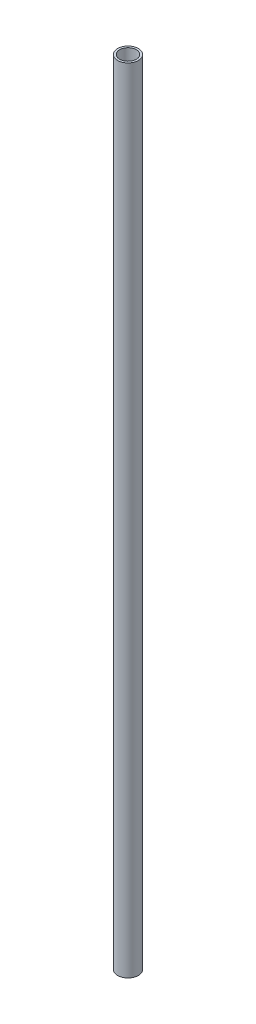
ISO-10303-21;
HEADER;
FILE_DESCRIPTION(('STEP AP214'),'2;1');
FILE_NAME('part.step','',(''),(''),'','','');
FILE_SCHEMA(('AUTOMOTIVE_DESIGN { 1 0 10303 214 1 1 1 1 }'));
ENDSEC;
DATA;
#1=APPLICATION_CONTEXT('core data for automotive mechanical design processes');
#2=APPLICATION_PROTOCOL_DEFINITION('international standard','automotive_design',2000,#1);
#3=PRODUCT_CONTEXT('',#1,'mechanical');
#4=PRODUCT('Part','Part','',(#3));
#5=PRODUCT_RELATED_PRODUCT_CATEGORY('part','',(#4));
#6=PRODUCT_DEFINITION_FORMATION('','',#4);
#7=PRODUCT_DEFINITION_CONTEXT('part definition',#1,'design');
#8=PRODUCT_DEFINITION('design','',#6,#7);
#9=PRODUCT_DEFINITION_SHAPE('','',#8);
#10=(LENGTH_UNIT() NAMED_UNIT(*) SI_UNIT(.MILLI.,.METRE.));
#11=(NAMED_UNIT(*) PLANE_ANGLE_UNIT() SI_UNIT($,.RADIAN.));
#12=(NAMED_UNIT(*) SI_UNIT($,.STERADIAN.) SOLID_ANGLE_UNIT());
#13=UNCERTAINTY_MEASURE_WITH_UNIT(LENGTH_MEASURE(1.E-05),#10,'distance_accuracy_value','');
#14=(GEOMETRIC_REPRESENTATION_CONTEXT(3) GLOBAL_UNCERTAINTY_ASSIGNED_CONTEXT((#13)) GLOBAL_UNIT_ASSIGNED_CONTEXT((#10,
#11,#12)) REPRESENTATION_CONTEXT('',''));
#15=CARTESIAN_POINT('',(0.,0.,0.));
#16=DIRECTION('',(0.,0.,1.));
#17=DIRECTION('',(1.,0.,0.));
#18=AXIS2_PLACEMENT_3D('',#15,#16,#17);
#19=CARTESIAN_POINT('',(0.,763.,0.));
#20=DIRECTION('',(0.,1.,0.));
#21=DIRECTION('',(0.,0.,1.));
#22=AXIS2_PLACEMENT_3D('',#19,#20,#21);
#23=PLANE('',#22);
#24=CARTESIAN_POINT('',(0.,763.,0.));
#25=DIRECTION('',(0.,1.,0.));
#26=DIRECTION('',(0.,0.,1.));
#27=AXIS2_PLACEMENT_3D('',#24,#25,#26);
#28=CIRCLE('',#27,10.);
#29=CARTESIAN_POINT('',(0.,763.,10.));
#30=VERTEX_POINT('',#29);
#31=EDGE_CURVE('E10',#30,#30,#28,.T.);
#32=ORIENTED_EDGE('',*,*,#31,.T.);
#33=EDGE_LOOP('',(#32));
#34=FACE_BOUND('',#33,.T.);
#35=CARTESIAN_POINT('',(0.,763.,0.));
#36=DIRECTION('',(0.,1.,0.));
#37=DIRECTION('',(0.,0.,1.));
#38=AXIS2_PLACEMENT_3D('',#35,#36,#37);
#39=CIRCLE('',#38,8.);
#40=CARTESIAN_POINT('',(0.,763.,8.));
#41=VERTEX_POINT('',#40);
#42=EDGE_CURVE('E44',#41,#41,#39,.T.);
#43=ORIENTED_EDGE('',*,*,#42,.F.);
#44=EDGE_LOOP('',(#43));
#45=FACE_BOUND('',#44,.T.);
#46=ADVANCED_FACE('F33',(#34,#45),#23,.T.);
#47=CARTESIAN_POINT('',(0.,0.,0.));
#48=DIRECTION('',(0.,1.,0.));
#49=DIRECTION('',(0.,0.,1.));
#50=AXIS2_PLACEMENT_3D('',#47,#48,#49);
#51=PLANE('',#50);
#52=CARTESIAN_POINT('',(0.,0.,0.));
#53=DIRECTION('',(0.,1.,0.));
#54=DIRECTION('',(0.,0.,1.));
#55=AXIS2_PLACEMENT_3D('',#52,#53,#54);
#56=CIRCLE('',#55,10.);
#57=CARTESIAN_POINT('',(0.,0.,10.));
#58=VERTEX_POINT('',#57);
#59=EDGE_CURVE('E37',#58,#58,#56,.T.);
#60=ORIENTED_EDGE('',*,*,#59,.F.);
#61=EDGE_LOOP('',(#60));
#62=FACE_BOUND('',#61,.T.);
#63=CARTESIAN_POINT('',(0.,0.,0.));
#64=DIRECTION('',(0.,1.,0.));
#65=DIRECTION('',(0.,0.,1.));
#66=AXIS2_PLACEMENT_3D('',#63,#64,#65);
#67=CIRCLE('',#66,8.);
#68=CARTESIAN_POINT('',(0.,0.,8.));
#69=VERTEX_POINT('',#68);
#70=EDGE_CURVE('E46',#69,#69,#67,.T.);
#71=ORIENTED_EDGE('',*,*,#70,.T.);
#72=EDGE_LOOP('',(#71));
#73=FACE_BOUND('',#72,.T.);
#74=ADVANCED_FACE('F56',(#62,#73),#51,.F.);
#75=CARTESIAN_POINT('',(0.,763.,0.));
#76=DIRECTION('',(0.,-1.,0.));
#77=DIRECTION('',(0.,0.,-1.));
#78=AXIS2_PLACEMENT_3D('',#75,#76,#77);
#79=CYLINDRICAL_SURFACE('',#78,10.);
#80=ORIENTED_EDGE('',*,*,#31,.F.);
#81=EDGE_LOOP('',(#80));
#82=FACE_BOUND('',#81,.T.);
#83=ORIENTED_EDGE('',*,*,#59,.T.);
#84=EDGE_LOOP('',(#83));
#85=FACE_BOUND('',#84,.T.);
#86=ADVANCED_FACE('F35',(#82,#85),#79,.T.);
#87=CARTESIAN_POINT('',(0.,763.,0.));
#88=DIRECTION('',(0.,-1.,0.));
#89=DIRECTION('',(0.,0.,-1.));
#90=AXIS2_PLACEMENT_3D('',#87,#88,#89);
#91=CYLINDRICAL_SURFACE('',#90,8.);
#92=ORIENTED_EDGE('',*,*,#42,.T.);
#93=EDGE_LOOP('',(#92));
#94=FACE_BOUND('',#93,.T.);
#95=ORIENTED_EDGE('',*,*,#70,.F.);
#96=EDGE_LOOP('',(#95));
#97=FACE_BOUND('',#96,.T.);
#98=ADVANCED_FACE('F52',(#94,#97),#91,.F.);
#99=CLOSED_SHELL('',(#46,#74,#86,#98));
#100=MANIFOLD_SOLID_BREP('B2',#99);
#101=ADVANCED_BREP_SHAPE_REPRESENTATION('',(#18,#100),#14);
#102=SHAPE_DEFINITION_REPRESENTATION(#9,#101);
ENDSEC;
END-ISO-10303-21;
